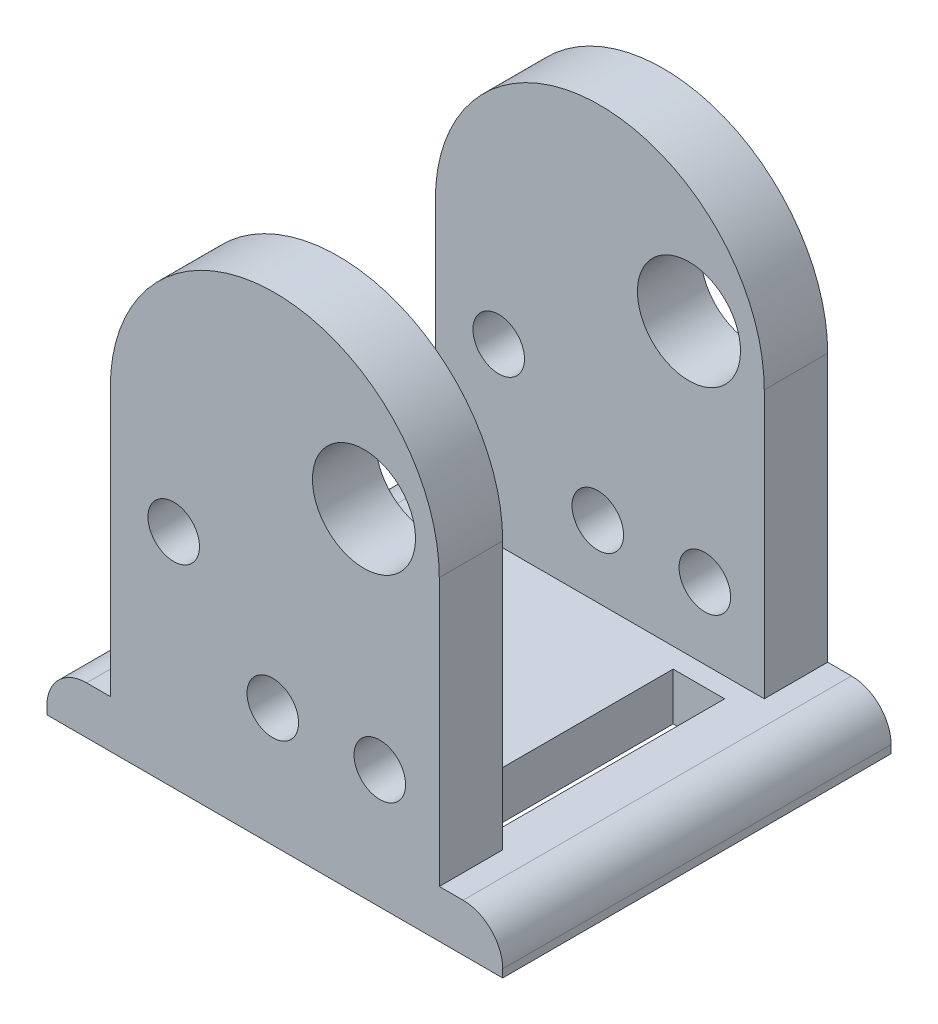
ISO-10303-21;
HEADER;
FILE_DESCRIPTION(('STEP AP214'),'2;1');
FILE_NAME('part.step','',(''),(''),'','','');
FILE_SCHEMA(('AUTOMOTIVE_DESIGN { 1 0 10303 214 1 1 1 1 }'));
ENDSEC;
DATA;
#1=APPLICATION_CONTEXT('core data for automotive mechanical design processes');
#2=APPLICATION_PROTOCOL_DEFINITION('international standard','automotive_design',2000,#1);
#3=PRODUCT_CONTEXT('',#1,'mechanical');
#4=PRODUCT('Part','Part','',(#3));
#5=PRODUCT_RELATED_PRODUCT_CATEGORY('part','',(#4));
#6=PRODUCT_DEFINITION_FORMATION('','',#4);
#7=PRODUCT_DEFINITION_CONTEXT('part definition',#1,'design');
#8=PRODUCT_DEFINITION('design','',#6,#7);
#9=PRODUCT_DEFINITION_SHAPE('','',#8);
#10=(LENGTH_UNIT() NAMED_UNIT(*) SI_UNIT(.MILLI.,.METRE.));
#11=(NAMED_UNIT(*) PLANE_ANGLE_UNIT() SI_UNIT($,.RADIAN.));
#12=(NAMED_UNIT(*) SI_UNIT($,.STERADIAN.) SOLID_ANGLE_UNIT());
#13=UNCERTAINTY_MEASURE_WITH_UNIT(LENGTH_MEASURE(1.E-05),#10,'distance_accuracy_value','');
#14=(GEOMETRIC_REPRESENTATION_CONTEXT(3) GLOBAL_UNCERTAINTY_ASSIGNED_CONTEXT((#13)) GLOBAL_UNIT_ASSIGNED_CONTEXT((#10,
#11,#12)) REPRESENTATION_CONTEXT('',''));
#15=CARTESIAN_POINT('',(0.,0.,0.));
#16=DIRECTION('',(0.,0.,1.));
#17=DIRECTION('',(1.,0.,0.));
#18=AXIS2_PLACEMENT_3D('',#15,#16,#17);
#19=CARTESIAN_POINT('',(10.541,20.193,24.892));
#20=DIRECTION('',(-1.,0.,0.));
#21=DIRECTION('',(0.,-1.,0.));
#22=AXIS2_PLACEMENT_3D('',#19,#20,#21);
#23=PLANE('',#22);
#24=DIRECTION('',(0.,0.,-1.));
#25=VECTOR('',#24,1.);
#26=CARTESIAN_POINT('',(10.541,20.193,24.892));
#27=LINE('',#26,#25);
#28=CARTESIAN_POINT('',(10.541,20.193,4.06399999999999));
#29=VERTEX_POINT('',#28);
#30=CARTESIAN_POINT('',(10.541,20.193,0.));
#31=VERTEX_POINT('',#30);
#32=EDGE_CURVE('E359',#29,#31,#27,.T.);
#33=ORIENTED_EDGE('',*,*,#32,.F.);
#34=DIRECTION('',(0.,1.,0.));
#35=VECTOR('',#34,1.);
#36=CARTESIAN_POINT('',(10.541,3.048,4.06399999999999));
#37=LINE('',#36,#35);
#38=CARTESIAN_POINT('',(10.541,3.048,4.06399999999999));
#39=VERTEX_POINT('',#38);
#40=EDGE_CURVE('E300',#39,#29,#37,.T.);
#41=ORIENTED_EDGE('',*,*,#40,.F.);
#42=DIRECTION('',(0.,0.,-1.));
#43=VECTOR('',#42,1.);
#44=CARTESIAN_POINT('',(10.541,3.048,24.892));
#45=LINE('',#44,#43);
#46=CARTESIAN_POINT('',(10.541,3.048,0.));
#47=VERTEX_POINT('',#46);
#48=EDGE_CURVE('E363',#39,#47,#45,.T.);
#49=ORIENTED_EDGE('',*,*,#48,.T.);
#50=DIRECTION('',(0.,1.,0.));
#51=VECTOR('',#50,1.);
#52=CARTESIAN_POINT('',(10.541,20.193,0.));
#53=LINE('',#52,#51);
#54=EDGE_CURVE('E341',#47,#31,#53,.T.);
#55=ORIENTED_EDGE('',*,*,#54,.T.);
#56=EDGE_LOOP('',(#33,#41,#49,#55));
#57=FACE_BOUND('',#56,.T.);
#58=ADVANCED_FACE('F33',(#57),#23,.F.);
#59=CARTESIAN_POINT('',(0.,20.193,24.892));
#60=DIRECTION('',(0.,0.,-1.));
#61=DIRECTION('',(-1.,0.,0.));
#62=AXIS2_PLACEMENT_3D('',#59,#60,#61);
#63=CYLINDRICAL_SURFACE('',#62,10.541);
#64=DIRECTION('',(0.,0.,-1.));
#65=VECTOR('',#64,1.);
#66=CARTESIAN_POINT('',(-10.541,20.193,24.892));
#67=LINE('',#66,#65);
#68=CARTESIAN_POINT('',(-10.541,20.193,4.06399999999999));
#69=VERTEX_POINT('',#68);
#70=CARTESIAN_POINT('',(-10.541,20.193,0.));
#71=VERTEX_POINT('',#70);
#72=EDGE_CURVE('E355',#69,#71,#67,.T.);
#73=ORIENTED_EDGE('',*,*,#72,.F.);
#74=CARTESIAN_POINT('',(0.,20.193,4.06399999999999));
#75=DIRECTION('',(0.,0.,-1.));
#76=DIRECTION('',(0.,1.,0.));
#77=AXIS2_PLACEMENT_3D('',#74,#75,#76);
#78=CIRCLE('',#77,10.541);
#79=EDGE_CURVE('E298',#29,#69,#78,.F.);
#80=ORIENTED_EDGE('',*,*,#79,.F.);
#81=ORIENTED_EDGE('',*,*,#32,.T.);
#82=CARTESIAN_POINT('',(0.,20.193,0.));
#83=DIRECTION('',(0.,0.,1.));
#84=DIRECTION('',(-1.,0.,0.));
#85=AXIS2_PLACEMENT_3D('',#82,#83,#84);
#86=CIRCLE('',#85,10.541);
#87=EDGE_CURVE('E344',#31,#71,#86,.T.);
#88=ORIENTED_EDGE('',*,*,#87,.T.);
#89=EDGE_LOOP('',(#73,#80,#81,#88));
#90=FACE_BOUND('',#89,.T.);
#91=ADVANCED_FACE('F422',(#90),#63,.T.);
#92=CARTESIAN_POINT('',(-10.541,3.048,24.892));
#93=DIRECTION('',(1.,0.,0.));
#94=DIRECTION('',(0.,1.,0.));
#95=AXIS2_PLACEMENT_3D('',#92,#93,#94);
#96=PLANE('',#95);
#97=DIRECTION('',(0.,0.,-1.));
#98=VECTOR('',#97,1.);
#99=CARTESIAN_POINT('',(-10.541,3.048,24.892));
#100=LINE('',#99,#98);
#101=CARTESIAN_POINT('',(-10.541,3.048,4.06399999999999));
#102=VERTEX_POINT('',#101);
#103=CARTESIAN_POINT('',(-10.541,3.048,0.));
#104=VERTEX_POINT('',#103);
#105=EDGE_CURVE('E333',#102,#104,#100,.T.);
#106=ORIENTED_EDGE('',*,*,#105,.F.);
#107=DIRECTION('',(0.,-1.,0.));
#108=VECTOR('',#107,1.);
#109=CARTESIAN_POINT('',(-10.541,3.048,4.06399999999999));
#110=LINE('',#109,#108);
#111=EDGE_CURVE('E304',#69,#102,#110,.T.);
#112=ORIENTED_EDGE('',*,*,#111,.F.);
#113=ORIENTED_EDGE('',*,*,#72,.T.);
#114=DIRECTION('',(0.,-1.,0.));
#115=VECTOR('',#114,1.);
#116=CARTESIAN_POINT('',(-10.541,3.048,0.));
#117=LINE('',#116,#115);
#118=EDGE_CURVE('E347',#71,#104,#117,.T.);
#119=ORIENTED_EDGE('',*,*,#118,.T.);
#120=EDGE_LOOP('',(#106,#112,#113,#119));
#121=FACE_BOUND('',#120,.T.);
#122=ADVANCED_FACE('F416',(#121),#96,.F.);
#123=CARTESIAN_POINT('',(-14.605,0.,24.892));
#124=DIRECTION('',(1.,0.,0.));
#125=DIRECTION('',(0.,0.,-1.));
#126=AXIS2_PLACEMENT_3D('',#123,#124,#125);
#127=PLANE('',#126);
#128=DIRECTION('',(0.,-1.,0.));
#129=VECTOR('',#128,1.);
#130=CARTESIAN_POINT('',(-14.605,0.,24.892));
#131=LINE('',#130,#129);
#132=CARTESIAN_POINT('',(-14.605,0.508,24.892));
#133=VERTEX_POINT('',#132);
#134=CARTESIAN_POINT('',(-14.605,0.,24.892));
#135=VERTEX_POINT('',#134);
#136=EDGE_CURVE('E315',#133,#135,#131,.T.);
#137=ORIENTED_EDGE('',*,*,#136,.F.);
#138=DIRECTION('',(0.,0.,-1.));
#139=VECTOR('',#138,1.);
#140=CARTESIAN_POINT('',(-14.605,0.508,24.892));
#141=LINE('',#140,#139);
#142=CARTESIAN_POINT('',(-14.605,0.508,0.));
#143=VERTEX_POINT('',#142);
#144=EDGE_CURVE('E373',#133,#143,#141,.T.);
#145=ORIENTED_EDGE('',*,*,#144,.T.);
#146=DIRECTION('',(0.,-1.,0.));
#147=VECTOR('',#146,1.);
#148=CARTESIAN_POINT('',(-14.605,0.,0.));
#149=LINE('',#148,#147);
#150=CARTESIAN_POINT('',(-14.605,0.,0.));
#151=VERTEX_POINT('',#150);
#152=EDGE_CURVE('E314',#143,#151,#149,.T.);
#153=ORIENTED_EDGE('',*,*,#152,.T.);
#154=DIRECTION('',(0.,0.,-1.));
#155=VECTOR('',#154,1.);
#156=CARTESIAN_POINT('',(-14.605,0.,24.892));
#157=LINE('',#156,#155);
#158=EDGE_CURVE('E370',#135,#151,#157,.T.);
#159=ORIENTED_EDGE('',*,*,#158,.F.);
#160=EDGE_LOOP('',(#137,#145,#153,#159));
#161=FACE_BOUND('',#160,.T.);
#162=ADVANCED_FACE('F403',(#161),#127,.F.);
#163=CARTESIAN_POINT('',(-14.605,0.,24.892));
#164=DIRECTION('',(0.,1.,0.));
#165=DIRECTION('',(0.,0.,1.));
#166=AXIS2_PLACEMENT_3D('',#163,#164,#165);
#167=PLANE('',#166);
#168=DIRECTION('',(1.,0.,0.));
#169=VECTOR('',#168,1.);
#170=CARTESIAN_POINT('',(5.969,0.,5.334));
#171=LINE('',#170,#169);
#172=CARTESIAN_POINT('',(5.969,0.,5.334));
#173=VERTEX_POINT('',#172);
#174=CARTESIAN_POINT('',(9.271,0.,5.334));
#175=VERTEX_POINT('',#174);
#176=EDGE_CURVE('E210',#173,#175,#171,.T.);
#177=ORIENTED_EDGE('',*,*,#176,.F.);
#178=DIRECTION('',(0.,0.,-1.));
#179=VECTOR('',#178,1.);
#180=CARTESIAN_POINT('',(5.969,0.,19.558));
#181=LINE('',#180,#179);
#182=CARTESIAN_POINT('',(5.969,0.,19.558));
#183=VERTEX_POINT('',#182);
#184=EDGE_CURVE('E189',#183,#173,#181,.T.);
#185=ORIENTED_EDGE('',*,*,#184,.F.);
#186=DIRECTION('',(-1.,0.,0.));
#187=VECTOR('',#186,1.);
#188=CARTESIAN_POINT('',(5.969,0.,19.558));
#189=LINE('',#188,#187);
#190=CARTESIAN_POINT('',(9.271,0.,19.558));
#191=VERTEX_POINT('',#190);
#192=EDGE_CURVE('E194',#191,#183,#189,.T.);
#193=ORIENTED_EDGE('',*,*,#192,.F.);
#194=DIRECTION('',(0.,0.,1.));
#195=VECTOR('',#194,1.);
#196=CARTESIAN_POINT('',(9.271,0.,19.558));
#197=LINE('',#196,#195);
#198=EDGE_CURVE('E217',#175,#191,#197,.T.);
#199=ORIENTED_EDGE('',*,*,#198,.F.);
#200=EDGE_LOOP('',(#177,#185,#193,#199));
#201=FACE_BOUND('',#200,.T.);
#202=DIRECTION('',(1.,0.,0.));
#203=VECTOR('',#202,1.);
#204=CARTESIAN_POINT('',(-9.22681859443985,0.,5.334));
#205=LINE('',#204,#203);
#206=CARTESIAN_POINT('',(-9.22681859443985,0.,5.334));
#207=VERTEX_POINT('',#206);
#208=CARTESIAN_POINT('',(-5.41681859443985,0.,5.334));
#209=VERTEX_POINT('',#208);
#210=EDGE_CURVE('E235',#207,#209,#205,.T.);
#211=ORIENTED_EDGE('',*,*,#210,.F.);
#212=DIRECTION('',(0.,0.,-1.));
#213=VECTOR('',#212,1.);
#214=CARTESIAN_POINT('',(-9.22681859443985,0.,19.558));
#215=LINE('',#214,#213);
#216=CARTESIAN_POINT('',(-9.22681859443985,0.,19.558));
#217=VERTEX_POINT('',#216);
#218=EDGE_CURVE('E233',#217,#207,#215,.T.);
#219=ORIENTED_EDGE('',*,*,#218,.F.);
#220=DIRECTION('',(-1.,0.,0.));
#221=VECTOR('',#220,1.);
#222=CARTESIAN_POINT('',(-9.22681859443985,0.,19.558));
#223=LINE('',#222,#221);
#224=CARTESIAN_POINT('',(-5.41681859443985,0.,19.558));
#225=VERTEX_POINT('',#224);
#226=EDGE_CURVE('E241',#225,#217,#223,.T.);
#227=ORIENTED_EDGE('',*,*,#226,.F.);
#228=DIRECTION('',(0.,0.,1.));
#229=VECTOR('',#228,1.);
#230=CARTESIAN_POINT('',(-5.41681859443985,0.,19.558));
#231=LINE('',#230,#229);
#232=EDGE_CURVE('E238',#209,#225,#231,.T.);
#233=ORIENTED_EDGE('',*,*,#232,.F.);
#234=EDGE_LOOP('',(#211,#219,#227,#233));
#235=FACE_BOUND('',#234,.T.);
#236=DIRECTION('',(1.,0.,0.));
#237=VECTOR('',#236,1.);
#238=CARTESIAN_POINT('',(-14.605,0.,0.));
#239=LINE('',#238,#237);
#240=CARTESIAN_POINT('',(14.605,0.,0.));
#241=VERTEX_POINT('',#240);
#242=EDGE_CURVE('E335',#151,#241,#239,.T.);
#243=ORIENTED_EDGE('',*,*,#242,.T.);
#244=DIRECTION('',(0.,0.,-1.));
#245=VECTOR('',#244,1.);
#246=CARTESIAN_POINT('',(14.605,0.,24.892));
#247=LINE('',#246,#245);
#248=CARTESIAN_POINT('',(14.605,0.,24.892));
#249=VERTEX_POINT('',#248);
#250=EDGE_CURVE('E367',#249,#241,#247,.T.);
#251=ORIENTED_EDGE('',*,*,#250,.F.);
#252=DIRECTION('',(1.,0.,0.));
#253=VECTOR('',#252,1.);
#254=CARTESIAN_POINT('',(-14.605,0.,24.892));
#255=LINE('',#254,#253);
#256=EDGE_CURVE('E317',#135,#249,#255,.T.);
#257=ORIENTED_EDGE('',*,*,#256,.F.);
#258=ORIENTED_EDGE('',*,*,#158,.T.);
#259=EDGE_LOOP('',(#243,#251,#257,#258));
#260=FACE_BOUND('',#259,.T.);
#261=ADVANCED_FACE('F454',(#201,#235,#260),#167,.F.);
#262=CARTESIAN_POINT('',(14.605,3.048,24.892));
#263=DIRECTION('',(-1.,0.,0.));
#264=DIRECTION('',(0.,0.,1.));
#265=AXIS2_PLACEMENT_3D('',#262,#263,#264);
#266=PLANE('',#265);
#267=DIRECTION('',(0.,1.,0.));
#268=VECTOR('',#267,1.);
#269=CARTESIAN_POINT('',(14.605,3.048,0.));
#270=LINE('',#269,#268);
#271=CARTESIAN_POINT('',(14.605,0.508000000000001,0.));
#272=VERTEX_POINT('',#271);
#273=EDGE_CURVE('E337',#241,#272,#270,.T.);
#274=ORIENTED_EDGE('',*,*,#273,.T.);
#275=DIRECTION('',(0.,0.,-1.));
#276=VECTOR('',#275,1.);
#277=CARTESIAN_POINT('',(14.605,0.508,24.892));
#278=LINE('',#277,#276);
#279=CARTESIAN_POINT('',(14.605,0.508000000000001,24.892));
#280=VERTEX_POINT('',#279);
#281=EDGE_CURVE('E11',#272,#280,#278,.F.);
#282=ORIENTED_EDGE('',*,*,#281,.T.);
#283=DIRECTION('',(0.,1.,0.));
#284=VECTOR('',#283,1.);
#285=CARTESIAN_POINT('',(14.605,3.048,24.892));
#286=LINE('',#285,#284);
#287=EDGE_CURVE('E320',#249,#280,#286,.T.);
#288=ORIENTED_EDGE('',*,*,#287,.F.);
#289=ORIENTED_EDGE('',*,*,#250,.T.);
#290=EDGE_LOOP('',(#274,#282,#288,#289));
#291=FACE_BOUND('',#290,.T.);
#292=ADVANCED_FACE('F431',(#291),#266,.F.);
#293=CARTESIAN_POINT('',(10.541,3.048,24.892));
#294=VERTEX_POINT('',#293);
#295=CARTESIAN_POINT('',(10.541,3.048,20.828));
#296=VERTEX_POINT('',#295);
#297=EDGE_CURVE('E364',#294,#296,#45,.T.);
#298=ORIENTED_EDGE('',*,*,#297,.T.);
#299=DIRECTION('',(0.,-1.,0.));
#300=VECTOR('',#299,1.);
#301=CARTESIAN_POINT('',(10.541,30.734,20.828));
#302=LINE('',#301,#300);
#303=CARTESIAN_POINT('',(10.541,20.193,20.828));
#304=VERTEX_POINT('',#303);
#305=EDGE_CURVE('E310',#304,#296,#302,.T.);
#306=ORIENTED_EDGE('',*,*,#305,.F.);
#307=CARTESIAN_POINT('',(10.541,20.193,24.892));
#308=VERTEX_POINT('',#307);
#309=EDGE_CURVE('E360',#308,#304,#27,.T.);
#310=ORIENTED_EDGE('',*,*,#309,.F.);
#311=DIRECTION('',(0.,1.,0.));
#312=VECTOR('',#311,1.);
#313=CARTESIAN_POINT('',(10.541,20.193,24.892));
#314=LINE('',#313,#312);
#315=EDGE_CURVE('E324',#294,#308,#314,.T.);
#316=ORIENTED_EDGE('',*,*,#315,.F.);
#317=EDGE_LOOP('',(#298,#306,#310,#316));
#318=FACE_BOUND('',#317,.T.);
#319=ADVANCED_FACE('F439',(#318),#23,.F.);
#320=ORIENTED_EDGE('',*,*,#309,.T.);
#321=CARTESIAN_POINT('',(0.,20.193,20.828));
#322=DIRECTION('',(0.,0.,1.));
#323=DIRECTION('',(0.,-1.,0.));
#324=AXIS2_PLACEMENT_3D('',#321,#322,#323);
#325=CIRCLE('',#324,10.541);
#326=CARTESIAN_POINT('',(-10.541,20.193,20.828));
#327=VERTEX_POINT('',#326);
#328=EDGE_CURVE('E296',#327,#304,#325,.F.);
#329=ORIENTED_EDGE('',*,*,#328,.F.);
#330=CARTESIAN_POINT('',(-10.541,20.193,24.892));
#331=VERTEX_POINT('',#330);
#332=EDGE_CURVE('E356',#331,#327,#67,.T.);
#333=ORIENTED_EDGE('',*,*,#332,.F.);
#334=CARTESIAN_POINT('',(0.,20.193,24.892));
#335=DIRECTION('',(0.,0.,1.));
#336=DIRECTION('',(-1.,0.,0.));
#337=AXIS2_PLACEMENT_3D('',#334,#335,#336);
#338=CIRCLE('',#337,10.541);
#339=EDGE_CURVE('E326',#308,#331,#338,.T.);
#340=ORIENTED_EDGE('',*,*,#339,.F.);
#341=EDGE_LOOP('',(#320,#329,#333,#340));
#342=FACE_BOUND('',#341,.T.);
#343=ADVANCED_FACE('F444',(#342),#63,.T.);
#344=ORIENTED_EDGE('',*,*,#332,.T.);
#345=DIRECTION('',(0.,1.,0.));
#346=VECTOR('',#345,1.);
#347=CARTESIAN_POINT('',(-10.541,30.734,20.828));
#348=LINE('',#347,#346);
#349=CARTESIAN_POINT('',(-10.541,3.048,20.828));
#350=VERTEX_POINT('',#349);
#351=EDGE_CURVE('E302',#350,#327,#348,.T.);
#352=ORIENTED_EDGE('',*,*,#351,.F.);
#353=CARTESIAN_POINT('',(-10.541,3.048,24.892));
#354=VERTEX_POINT('',#353);
#355=EDGE_CURVE('E352',#354,#350,#100,.T.);
#356=ORIENTED_EDGE('',*,*,#355,.F.);
#357=DIRECTION('',(0.,-1.,0.));
#358=VECTOR('',#357,1.);
#359=CARTESIAN_POINT('',(-10.541,3.048,24.892));
#360=LINE('',#359,#358);
#361=EDGE_CURVE('E328',#331,#354,#360,.T.);
#362=ORIENTED_EDGE('',*,*,#361,.F.);
#363=EDGE_LOOP('',(#344,#352,#356,#362));
#364=FACE_BOUND('',#363,.T.);
#365=ADVANCED_FACE('F452',(#364),#96,.F.);
#366=CARTESIAN_POINT('',(-14.605,3.048,24.892));
#367=DIRECTION('',(0.,-1.,0.));
#368=DIRECTION('',(0.,0.,-1.));
#369=AXIS2_PLACEMENT_3D('',#366,#367,#368);
#370=PLANE('',#369);
#371=DIRECTION('',(1.,0.,0.));
#372=VECTOR('',#371,1.);
#373=CARTESIAN_POINT('',(5.969,3.048,19.558));
#374=LINE('',#373,#372);
#375=CARTESIAN_POINT('',(5.969,3.048,19.558));
#376=VERTEX_POINT('',#375);
#377=CARTESIAN_POINT('',(9.271,3.048,19.558));
#378=VERTEX_POINT('',#377);
#379=EDGE_CURVE('E208',#376,#378,#374,.T.);
#380=ORIENTED_EDGE('',*,*,#379,.F.);
#381=DIRECTION('',(0.,0.,1.));
#382=VECTOR('',#381,1.);
#383=CARTESIAN_POINT('',(5.969,3.048,19.558));
#384=LINE('',#383,#382);
#385=CARTESIAN_POINT('',(5.969,3.048,5.334));
#386=VERTEX_POINT('',#385);
#387=EDGE_CURVE('E186',#386,#376,#384,.T.);
#388=ORIENTED_EDGE('',*,*,#387,.F.);
#389=DIRECTION('',(-1.,0.,0.));
#390=VECTOR('',#389,1.);
#391=CARTESIAN_POINT('',(5.969,3.048,5.334));
#392=LINE('',#391,#390);
#393=CARTESIAN_POINT('',(9.271,3.048,5.334));
#394=VERTEX_POINT('',#393);
#395=EDGE_CURVE('E198',#394,#386,#392,.T.);
#396=ORIENTED_EDGE('',*,*,#395,.F.);
#397=DIRECTION('',(0.,0.,-1.));
#398=VECTOR('',#397,1.);
#399=CARTESIAN_POINT('',(9.271,3.048,19.558));
#400=LINE('',#399,#398);
#401=EDGE_CURVE('E212',#378,#394,#400,.T.);
#402=ORIENTED_EDGE('',*,*,#401,.F.);
#403=EDGE_LOOP('',(#380,#388,#396,#402));
#404=FACE_BOUND('',#403,.T.);
#405=DIRECTION('',(1.,0.,0.));
#406=VECTOR('',#405,1.);
#407=CARTESIAN_POINT('',(-9.22681859443985,3.048,19.558));
#408=LINE('',#407,#406);
#409=CARTESIAN_POINT('',(-9.22681859443985,3.048,19.558));
#410=VERTEX_POINT('',#409);
#411=CARTESIAN_POINT('',(-5.41681859443985,3.048,19.558));
#412=VERTEX_POINT('',#411);
#413=EDGE_CURVE('E227',#410,#412,#408,.T.);
#414=ORIENTED_EDGE('',*,*,#413,.F.);
#415=DIRECTION('',(0.,0.,1.));
#416=VECTOR('',#415,1.);
#417=CARTESIAN_POINT('',(-9.22681859443985,3.048,19.558));
#418=LINE('',#417,#416);
#419=CARTESIAN_POINT('',(-9.22681859443985,3.048,5.334));
#420=VERTEX_POINT('',#419);
#421=EDGE_CURVE('E230',#420,#410,#418,.T.);
#422=ORIENTED_EDGE('',*,*,#421,.F.);
#423=DIRECTION('',(-1.,0.,0.));
#424=VECTOR('',#423,1.);
#425=CARTESIAN_POINT('',(-9.22681859443985,3.048,5.334));
#426=LINE('',#425,#424);
#427=CARTESIAN_POINT('',(-5.41681859443985,3.048,5.334));
#428=VERTEX_POINT('',#427);
#429=EDGE_CURVE('E247',#428,#420,#426,.T.);
#430=ORIENTED_EDGE('',*,*,#429,.F.);
#431=DIRECTION('',(0.,0.,-1.));
#432=VECTOR('',#431,1.);
#433=CARTESIAN_POINT('',(-5.41681859443985,3.048,19.558));
#434=LINE('',#433,#432);
#435=EDGE_CURVE('E202',#412,#428,#434,.T.);
#436=ORIENTED_EDGE('',*,*,#435,.F.);
#437=EDGE_LOOP('',(#414,#422,#430,#436));
#438=FACE_BOUND('',#437,.T.);
#439=DIRECTION('',(-1.,0.,0.));
#440=VECTOR('',#439,1.);
#441=CARTESIAN_POINT('',(-14.605,3.048,0.));
#442=LINE('',#441,#440);
#443=CARTESIAN_POINT('',(-12.065,3.048,0.));
#444=VERTEX_POINT('',#443);
#445=EDGE_CURVE('E318',#104,#444,#442,.T.);
#446=ORIENTED_EDGE('',*,*,#445,.T.);
#447=DIRECTION('',(0.,0.,-1.));
#448=VECTOR('',#447,1.);
#449=CARTESIAN_POINT('',(-12.065,3.048,24.892));
#450=LINE('',#449,#448);
#451=CARTESIAN_POINT('',(-12.065,3.048,24.892));
#452=VERTEX_POINT('',#451);
#453=EDGE_CURVE('E391',#444,#452,#450,.F.);
#454=ORIENTED_EDGE('',*,*,#453,.T.);
#455=DIRECTION('',(-1.,0.,0.));
#456=VECTOR('',#455,1.);
#457=CARTESIAN_POINT('',(-14.605,3.048,24.892));
#458=LINE('',#457,#456);
#459=EDGE_CURVE('E330',#354,#452,#458,.T.);
#460=ORIENTED_EDGE('',*,*,#459,.F.);
#461=ORIENTED_EDGE('',*,*,#355,.T.);
#462=DIRECTION('',(-1.,0.,0.));
#463=VECTOR('',#462,1.);
#464=CARTESIAN_POINT('',(14.606,3.048,20.828));
#465=LINE('',#464,#463);
#466=EDGE_CURVE('E306',#296,#350,#465,.T.);
#467=ORIENTED_EDGE('',*,*,#466,.F.);
#468=ORIENTED_EDGE('',*,*,#297,.F.);
#469=DIRECTION('',(-1.,0.,0.));
#470=VECTOR('',#469,1.);
#471=CARTESIAN_POINT('',(10.541,3.048,24.892));
#472=LINE('',#471,#470);
#473=CARTESIAN_POINT('',(12.065,3.048,24.892));
#474=VERTEX_POINT('',#473);
#475=EDGE_CURVE('E322',#474,#294,#472,.T.);
#476=ORIENTED_EDGE('',*,*,#475,.F.);
#477=DIRECTION('',(0.,0.,-1.));
#478=VECTOR('',#477,1.);
#479=CARTESIAN_POINT('',(12.065,3.048,24.892));
#480=LINE('',#479,#478);
#481=CARTESIAN_POINT('',(12.065,3.048,0.));
#482=VERTEX_POINT('',#481);
#483=EDGE_CURVE('E388',#474,#482,#480,.T.);
#484=ORIENTED_EDGE('',*,*,#483,.T.);
#485=DIRECTION('',(-1.,0.,0.));
#486=VECTOR('',#485,1.);
#487=CARTESIAN_POINT('',(10.541,3.048,0.));
#488=LINE('',#487,#486);
#489=EDGE_CURVE('E339',#482,#47,#488,.T.);
#490=ORIENTED_EDGE('',*,*,#489,.T.);
#491=ORIENTED_EDGE('',*,*,#48,.F.);
#492=DIRECTION('',(-1.,0.,0.));
#493=VECTOR('',#492,1.);
#494=CARTESIAN_POINT('',(14.606,3.048,4.06399999999999));
#495=LINE('',#494,#493);
#496=EDGE_CURVE('E307',#39,#102,#495,.T.);
#497=ORIENTED_EDGE('',*,*,#496,.T.);
#498=ORIENTED_EDGE('',*,*,#105,.T.);
#499=EDGE_LOOP('',(#446,#454,#460,#461,#467,#468,#476,#484,#490,#491,#497,#498));
#500=FACE_BOUND('',#499,.T.);
#501=ADVANCED_FACE('F205',(#404,#438,#500),#370,.F.);
#502=CARTESIAN_POINT('',(0.,20.193,24.892));
#503=DIRECTION('',(0.,0.,-1.));
#504=DIRECTION('',(-1.,0.,0.));
#505=AXIS2_PLACEMENT_3D('',#502,#503,#504);
#506=PLANE('',#505);
#507=CARTESIAN_POINT('',(-6.477,14.224,24.892));
#508=DIRECTION('',(0.,0.,-1.));
#509=DIRECTION('',(-1.,0.,0.));
#510=AXIS2_PLACEMENT_3D('',#507,#508,#509);
#511=CIRCLE('',#510,1.651);
#512=CARTESIAN_POINT('',(-8.128,14.224,24.892));
#513=VERTEX_POINT('',#512);
#514=EDGE_CURVE('E259',#513,#513,#511,.F.);
#515=ORIENTED_EDGE('',*,*,#514,.F.);
#516=EDGE_LOOP('',(#515));
#517=FACE_BOUND('',#516,.T.);
#518=CARTESIAN_POINT('',(-0.127,7.62,24.892));
#519=DIRECTION('',(0.,0.,-1.));
#520=DIRECTION('',(-1.,0.,0.));
#521=AXIS2_PLACEMENT_3D('',#518,#519,#520);
#522=CIRCLE('',#521,1.651);
#523=CARTESIAN_POINT('',(-1.778,7.62,24.892));
#524=VERTEX_POINT('',#523);
#525=EDGE_CURVE('E269',#524,#524,#522,.F.);
#526=ORIENTED_EDGE('',*,*,#525,.F.);
#527=EDGE_LOOP('',(#526));
#528=FACE_BOUND('',#527,.T.);
#529=CARTESIAN_POINT('',(6.731,7.62,24.892));
#530=DIRECTION('',(0.,0.,-1.));
#531=DIRECTION('',(-1.,0.,0.));
#532=AXIS2_PLACEMENT_3D('',#529,#530,#531);
#533=CIRCLE('',#532,1.651);
#534=CARTESIAN_POINT('',(5.08,7.62,24.892));
#535=VERTEX_POINT('',#534);
#536=EDGE_CURVE('E279',#535,#535,#533,.F.);
#537=ORIENTED_EDGE('',*,*,#536,.F.);
#538=EDGE_LOOP('',(#537));
#539=FACE_BOUND('',#538,.T.);
#540=CARTESIAN_POINT('',(5.715,21.59,24.892));
#541=DIRECTION('',(0.,0.,-1.));
#542=DIRECTION('',(-1.,0.,0.));
#543=AXIS2_PLACEMENT_3D('',#540,#541,#542);
#544=CIRCLE('',#543,3.302);
#545=CARTESIAN_POINT('',(2.413,21.59,24.892));
#546=VERTEX_POINT('',#545);
#547=EDGE_CURVE('E289',#546,#546,#544,.F.);
#548=ORIENTED_EDGE('',*,*,#547,.F.);
#549=EDGE_LOOP('',(#548));
#550=FACE_BOUND('',#549,.T.);
#551=ORIENTED_EDGE('',*,*,#459,.T.);
#552=CARTESIAN_POINT('',(-12.065,0.508,24.892));
#553=DIRECTION('',(0.,0.,-1.));
#554=DIRECTION('',(-1.,0.,0.));
#555=AXIS2_PLACEMENT_3D('',#552,#553,#554);
#556=CIRCLE('',#555,2.54);
#557=EDGE_CURVE('E41',#452,#133,#556,.F.);
#558=ORIENTED_EDGE('',*,*,#557,.T.);
#559=ORIENTED_EDGE('',*,*,#136,.T.);
#560=ORIENTED_EDGE('',*,*,#256,.T.);
#561=ORIENTED_EDGE('',*,*,#287,.T.);
#562=CARTESIAN_POINT('',(12.065,0.508,24.892));
#563=DIRECTION('',(0.,0.,-1.));
#564=DIRECTION('',(-1.,0.,0.));
#565=AXIS2_PLACEMENT_3D('',#562,#563,#564);
#566=CIRCLE('',#565,2.54);
#567=EDGE_CURVE('E53',#280,#474,#566,.F.);
#568=ORIENTED_EDGE('',*,*,#567,.T.);
#569=ORIENTED_EDGE('',*,*,#475,.T.);
#570=ORIENTED_EDGE('',*,*,#315,.T.);
#571=ORIENTED_EDGE('',*,*,#339,.T.);
#572=ORIENTED_EDGE('',*,*,#361,.T.);
#573=EDGE_LOOP('',(#551,#558,#559,#560,#561,#568,#569,#570,#571,#572));
#574=FACE_BOUND('',#573,.T.);
#575=ADVANCED_FACE('F395',(#517,#528,#539,#550,#574),#506,.F.);
#576=CARTESIAN_POINT('',(0.,20.193,0.));
#577=DIRECTION('',(0.,0.,-1.));
#578=DIRECTION('',(-1.,0.,0.));
#579=AXIS2_PLACEMENT_3D('',#576,#577,#578);
#580=PLANE('',#579);
#581=CARTESIAN_POINT('',(-6.477,14.224,0.));
#582=DIRECTION('',(0.,0.,-1.));
#583=DIRECTION('',(-1.,0.,0.));
#584=AXIS2_PLACEMENT_3D('',#581,#582,#583);
#585=CIRCLE('',#584,1.651);
#586=CARTESIAN_POINT('',(-8.128,14.224,0.));
#587=VERTEX_POINT('',#586);
#588=EDGE_CURVE('E256',#587,#587,#585,.T.);
#589=ORIENTED_EDGE('',*,*,#588,.F.);
#590=EDGE_LOOP('',(#589));
#591=FACE_BOUND('',#590,.T.);
#592=CARTESIAN_POINT('',(-0.127,7.62,0.));
#593=DIRECTION('',(0.,0.,-1.));
#594=DIRECTION('',(-1.,0.,0.));
#595=AXIS2_PLACEMENT_3D('',#592,#593,#594);
#596=CIRCLE('',#595,1.651);
#597=CARTESIAN_POINT('',(-1.778,7.62,0.));
#598=VERTEX_POINT('',#597);
#599=EDGE_CURVE('E266',#598,#598,#596,.T.);
#600=ORIENTED_EDGE('',*,*,#599,.F.);
#601=EDGE_LOOP('',(#600));
#602=FACE_BOUND('',#601,.T.);
#603=CARTESIAN_POINT('',(6.731,7.62,0.));
#604=DIRECTION('',(0.,0.,-1.));
#605=DIRECTION('',(-1.,0.,0.));
#606=AXIS2_PLACEMENT_3D('',#603,#604,#605);
#607=CIRCLE('',#606,1.651);
#608=CARTESIAN_POINT('',(5.08,7.62,0.));
#609=VERTEX_POINT('',#608);
#610=EDGE_CURVE('E276',#609,#609,#607,.T.);
#611=ORIENTED_EDGE('',*,*,#610,.F.);
#612=EDGE_LOOP('',(#611));
#613=FACE_BOUND('',#612,.T.);
#614=CARTESIAN_POINT('',(5.715,21.59,0.));
#615=DIRECTION('',(0.,0.,-1.));
#616=DIRECTION('',(-1.,0.,0.));
#617=AXIS2_PLACEMENT_3D('',#614,#615,#616);
#618=CIRCLE('',#617,3.302);
#619=CARTESIAN_POINT('',(2.413,21.59,0.));
#620=VERTEX_POINT('',#619);
#621=EDGE_CURVE('E286',#620,#620,#618,.T.);
#622=ORIENTED_EDGE('',*,*,#621,.F.);
#623=EDGE_LOOP('',(#622));
#624=FACE_BOUND('',#623,.T.);
#625=ORIENTED_EDGE('',*,*,#152,.F.);
#626=CARTESIAN_POINT('',(-12.065,0.508,0.));
#627=DIRECTION('',(0.,0.,-1.));
#628=DIRECTION('',(-1.,0.,0.));
#629=AXIS2_PLACEMENT_3D('',#626,#627,#628);
#630=CIRCLE('',#629,2.54);
#631=EDGE_CURVE('E386',#143,#444,#630,.T.);
#632=ORIENTED_EDGE('',*,*,#631,.T.);
#633=ORIENTED_EDGE('',*,*,#445,.F.);
#634=ORIENTED_EDGE('',*,*,#118,.F.);
#635=ORIENTED_EDGE('',*,*,#87,.F.);
#636=ORIENTED_EDGE('',*,*,#54,.F.);
#637=ORIENTED_EDGE('',*,*,#489,.F.);
#638=CARTESIAN_POINT('',(12.065,0.508,0.));
#639=DIRECTION('',(0.,0.,-1.));
#640=DIRECTION('',(-1.,0.,0.));
#641=AXIS2_PLACEMENT_3D('',#638,#639,#640);
#642=CIRCLE('',#641,2.54);
#643=EDGE_CURVE('E384',#482,#272,#642,.T.);
#644=ORIENTED_EDGE('',*,*,#643,.T.);
#645=ORIENTED_EDGE('',*,*,#273,.F.);
#646=ORIENTED_EDGE('',*,*,#242,.F.);
#647=EDGE_LOOP('',(#625,#632,#633,#634,#635,#636,#637,#644,#645,#646));
#648=FACE_BOUND('',#647,.T.);
#649=ADVANCED_FACE('F408',(#591,#602,#613,#624,#648),#580,.T.);
#650=CARTESIAN_POINT('',(14.606,3.048,4.06399999999999));
#651=DIRECTION('',(0.,0.,-1.));
#652=DIRECTION('',(0.,1.,0.));
#653=AXIS2_PLACEMENT_3D('',#650,#651,#652);
#654=PLANE('',#653);
#655=CARTESIAN_POINT('',(-6.477,14.224,4.06399999999999));
#656=DIRECTION('',(0.,0.,-1.));
#657=DIRECTION('',(0.,1.,0.));
#658=AXIS2_PLACEMENT_3D('',#655,#656,#657);
#659=CIRCLE('',#658,1.651);
#660=CARTESIAN_POINT('',(-6.477,15.875,4.06399999999999));
#661=VERTEX_POINT('',#660);
#662=EDGE_CURVE('E263',#661,#661,#659,.T.);
#663=ORIENTED_EDGE('',*,*,#662,.T.);
#664=EDGE_LOOP('',(#663));
#665=FACE_BOUND('',#664,.T.);
#666=CARTESIAN_POINT('',(-0.127,7.62,4.06399999999999));
#667=DIRECTION('',(0.,0.,-1.));
#668=DIRECTION('',(0.,1.,0.));
#669=AXIS2_PLACEMENT_3D('',#666,#667,#668);
#670=CIRCLE('',#669,1.651);
#671=CARTESIAN_POINT('',(-0.127,9.271,4.06399999999999));
#672=VERTEX_POINT('',#671);
#673=EDGE_CURVE('E273',#672,#672,#670,.T.);
#674=ORIENTED_EDGE('',*,*,#673,.T.);
#675=EDGE_LOOP('',(#674));
#676=FACE_BOUND('',#675,.T.);
#677=CARTESIAN_POINT('',(6.731,7.62,4.06399999999999));
#678=DIRECTION('',(0.,0.,-1.));
#679=DIRECTION('',(0.,1.,0.));
#680=AXIS2_PLACEMENT_3D('',#677,#678,#679);
#681=CIRCLE('',#680,1.651);
#682=CARTESIAN_POINT('',(6.731,9.271,4.06399999999999));
#683=VERTEX_POINT('',#682);
#684=EDGE_CURVE('E283',#683,#683,#681,.T.);
#685=ORIENTED_EDGE('',*,*,#684,.T.);
#686=EDGE_LOOP('',(#685));
#687=FACE_BOUND('',#686,.T.);
#688=CARTESIAN_POINT('',(5.715,21.59,4.06399999999999));
#689=DIRECTION('',(0.,0.,-1.));
#690=DIRECTION('',(0.,1.,0.));
#691=AXIS2_PLACEMENT_3D('',#688,#689,#690);
#692=CIRCLE('',#691,3.302);
#693=CARTESIAN_POINT('',(5.715,24.892,4.06399999999999));
#694=VERTEX_POINT('',#693);
#695=EDGE_CURVE('E293',#694,#694,#692,.T.);
#696=ORIENTED_EDGE('',*,*,#695,.T.);
#697=EDGE_LOOP('',(#696));
#698=FACE_BOUND('',#697,.T.);
#699=ORIENTED_EDGE('',*,*,#40,.T.);
#700=ORIENTED_EDGE('',*,*,#79,.T.);
#701=ORIENTED_EDGE('',*,*,#111,.T.);
#702=ORIENTED_EDGE('',*,*,#496,.F.);
#703=EDGE_LOOP('',(#699,#700,#701,#702));
#704=FACE_BOUND('',#703,.T.);
#705=ADVANCED_FACE('F538',(#665,#676,#687,#698,#704),#654,.F.);
#706=CARTESIAN_POINT('',(14.606,30.734,20.828));
#707=DIRECTION('',(0.,0.,1.));
#708=DIRECTION('',(0.,-1.,0.));
#709=AXIS2_PLACEMENT_3D('',#706,#707,#708);
#710=PLANE('',#709);
#711=CARTESIAN_POINT('',(-6.477,14.224,20.828));
#712=DIRECTION('',(0.,0.,1.));
#713=DIRECTION('',(0.,-1.,0.));
#714=AXIS2_PLACEMENT_3D('',#711,#712,#713);
#715=CIRCLE('',#714,1.651);
#716=CARTESIAN_POINT('',(-6.477,12.573,20.828));
#717=VERTEX_POINT('',#716);
#718=EDGE_CURVE('E262',#717,#717,#715,.T.);
#719=ORIENTED_EDGE('',*,*,#718,.T.);
#720=EDGE_LOOP('',(#719));
#721=FACE_BOUND('',#720,.T.);
#722=CARTESIAN_POINT('',(-0.127,7.62,20.828));
#723=DIRECTION('',(0.,0.,1.));
#724=DIRECTION('',(0.,-1.,0.));
#725=AXIS2_PLACEMENT_3D('',#722,#723,#724);
#726=CIRCLE('',#725,1.651);
#727=CARTESIAN_POINT('',(-0.127,5.969,20.828));
#728=VERTEX_POINT('',#727);
#729=EDGE_CURVE('E272',#728,#728,#726,.T.);
#730=ORIENTED_EDGE('',*,*,#729,.T.);
#731=EDGE_LOOP('',(#730));
#732=FACE_BOUND('',#731,.T.);
#733=CARTESIAN_POINT('',(6.731,7.62,20.828));
#734=DIRECTION('',(0.,0.,1.));
#735=DIRECTION('',(0.,-1.,0.));
#736=AXIS2_PLACEMENT_3D('',#733,#734,#735);
#737=CIRCLE('',#736,1.651);
#738=CARTESIAN_POINT('',(6.731,5.969,20.828));
#739=VERTEX_POINT('',#738);
#740=EDGE_CURVE('E282',#739,#739,#737,.T.);
#741=ORIENTED_EDGE('',*,*,#740,.T.);
#742=EDGE_LOOP('',(#741));
#743=FACE_BOUND('',#742,.T.);
#744=CARTESIAN_POINT('',(5.715,21.59,20.828));
#745=DIRECTION('',(0.,0.,1.));
#746=DIRECTION('',(0.,-1.,0.));
#747=AXIS2_PLACEMENT_3D('',#744,#745,#746);
#748=CIRCLE('',#747,3.302);
#749=CARTESIAN_POINT('',(5.715,18.288,20.828));
#750=VERTEX_POINT('',#749);
#751=EDGE_CURVE('E292',#750,#750,#748,.T.);
#752=ORIENTED_EDGE('',*,*,#751,.T.);
#753=EDGE_LOOP('',(#752));
#754=FACE_BOUND('',#753,.T.);
#755=ORIENTED_EDGE('',*,*,#305,.T.);
#756=ORIENTED_EDGE('',*,*,#466,.T.);
#757=ORIENTED_EDGE('',*,*,#351,.T.);
#758=ORIENTED_EDGE('',*,*,#328,.T.);
#759=EDGE_LOOP('',(#755,#756,#757,#758));
#760=FACE_BOUND('',#759,.T.);
#761=ADVANCED_FACE('F462',(#721,#732,#743,#754,#760),#710,.F.);
#762=CARTESIAN_POINT('',(5.715,21.59,34.2314663659119));
#763=DIRECTION('',(0.,0.,-1.));
#764=DIRECTION('',(-1.,0.,0.));
#765=AXIS2_PLACEMENT_3D('',#762,#763,#764);
#766=CYLINDRICAL_SURFACE('',#765,3.302);
#767=ORIENTED_EDGE('',*,*,#547,.T.);
#768=EDGE_LOOP('',(#767));
#769=FACE_BOUND('',#768,.T.);
#770=ORIENTED_EDGE('',*,*,#751,.F.);
#771=EDGE_LOOP('',(#770));
#772=FACE_BOUND('',#771,.T.);
#773=ADVANCED_FACE('F536',(#769,#772),#766,.F.);
#774=ORIENTED_EDGE('',*,*,#621,.T.);
#775=EDGE_LOOP('',(#774));
#776=FACE_BOUND('',#775,.T.);
#777=ORIENTED_EDGE('',*,*,#695,.F.);
#778=EDGE_LOOP('',(#777));
#779=FACE_BOUND('',#778,.T.);
#780=ADVANCED_FACE('F533',(#776,#779),#766,.F.);
#781=CARTESIAN_POINT('',(6.731,7.62,34.2314663659119));
#782=DIRECTION('',(0.,0.,-1.));
#783=DIRECTION('',(-1.,0.,0.));
#784=AXIS2_PLACEMENT_3D('',#781,#782,#783);
#785=CYLINDRICAL_SURFACE('',#784,1.651);
#786=ORIENTED_EDGE('',*,*,#536,.T.);
#787=EDGE_LOOP('',(#786));
#788=FACE_BOUND('',#787,.T.);
#789=ORIENTED_EDGE('',*,*,#740,.F.);
#790=EDGE_LOOP('',(#789));
#791=FACE_BOUND('',#790,.T.);
#792=ADVANCED_FACE('F531',(#788,#791),#785,.F.);
#793=ORIENTED_EDGE('',*,*,#610,.T.);
#794=EDGE_LOOP('',(#793));
#795=FACE_BOUND('',#794,.T.);
#796=ORIENTED_EDGE('',*,*,#684,.F.);
#797=EDGE_LOOP('',(#796));
#798=FACE_BOUND('',#797,.T.);
#799=ADVANCED_FACE('F528',(#795,#798),#785,.F.);
#800=CARTESIAN_POINT('',(-0.127,7.62,34.2314663659119));
#801=DIRECTION('',(0.,0.,-1.));
#802=DIRECTION('',(-1.,0.,0.));
#803=AXIS2_PLACEMENT_3D('',#800,#801,#802);
#804=CYLINDRICAL_SURFACE('',#803,1.651);
#805=ORIENTED_EDGE('',*,*,#525,.T.);
#806=EDGE_LOOP('',(#805));
#807=FACE_BOUND('',#806,.T.);
#808=ORIENTED_EDGE('',*,*,#729,.F.);
#809=EDGE_LOOP('',(#808));
#810=FACE_BOUND('',#809,.T.);
#811=ADVANCED_FACE('F526',(#807,#810),#804,.F.);
#812=ORIENTED_EDGE('',*,*,#599,.T.);
#813=EDGE_LOOP('',(#812));
#814=FACE_BOUND('',#813,.T.);
#815=ORIENTED_EDGE('',*,*,#673,.F.);
#816=EDGE_LOOP('',(#815));
#817=FACE_BOUND('',#816,.T.);
#818=ADVANCED_FACE('F523',(#814,#817),#804,.F.);
#819=CARTESIAN_POINT('',(-6.477,14.224,34.2314663659119));
#820=DIRECTION('',(0.,0.,-1.));
#821=DIRECTION('',(-1.,0.,0.));
#822=AXIS2_PLACEMENT_3D('',#819,#820,#821);
#823=CYLINDRICAL_SURFACE('',#822,1.651);
#824=ORIENTED_EDGE('',*,*,#514,.T.);
#825=EDGE_LOOP('',(#824));
#826=FACE_BOUND('',#825,.T.);
#827=ORIENTED_EDGE('',*,*,#718,.F.);
#828=EDGE_LOOP('',(#827));
#829=FACE_BOUND('',#828,.T.);
#830=ADVANCED_FACE('F521',(#826,#829),#823,.F.);
#831=ORIENTED_EDGE('',*,*,#588,.T.);
#832=EDGE_LOOP('',(#831));
#833=FACE_BOUND('',#832,.T.);
#834=ORIENTED_EDGE('',*,*,#662,.F.);
#835=EDGE_LOOP('',(#834));
#836=FACE_BOUND('',#835,.T.);
#837=ADVANCED_FACE('F518',(#833,#836),#823,.F.);
#838=CARTESIAN_POINT('',(-9.22681859443985,30.735,19.558));
#839=DIRECTION('',(-1.,0.,0.));
#840=DIRECTION('',(0.,0.,1.));
#841=AXIS2_PLACEMENT_3D('',#838,#839,#840);
#842=PLANE('',#841);
#843=ORIENTED_EDGE('',*,*,#421,.T.);
#844=DIRECTION('',(0.,-1.,0.));
#845=VECTOR('',#844,1.);
#846=CARTESIAN_POINT('',(-9.22681859443985,30.735,19.558));
#847=LINE('',#846,#845);
#848=EDGE_CURVE('E245',#410,#217,#847,.T.);
#849=ORIENTED_EDGE('',*,*,#848,.T.);
#850=ORIENTED_EDGE('',*,*,#218,.T.);
#851=DIRECTION('',(0.,-1.,0.));
#852=VECTOR('',#851,1.);
#853=CARTESIAN_POINT('',(-9.22681859443985,30.735,5.334));
#854=LINE('',#853,#852);
#855=EDGE_CURVE('E244',#420,#207,#854,.T.);
#856=ORIENTED_EDGE('',*,*,#855,.F.);
#857=EDGE_LOOP('',(#843,#849,#850,#856));
#858=FACE_BOUND('',#857,.T.);
#859=ADVANCED_FACE('F499',(#858),#842,.F.);
#860=CARTESIAN_POINT('',(-9.22681859443985,30.735,19.558));
#861=DIRECTION('',(0.,0.,1.));
#862=DIRECTION('',(1.,0.,0.));
#863=AXIS2_PLACEMENT_3D('',#860,#861,#862);
#864=PLANE('',#863);
#865=ORIENTED_EDGE('',*,*,#413,.T.);
#866=DIRECTION('',(0.,-1.,0.));
#867=VECTOR('',#866,1.);
#868=CARTESIAN_POINT('',(-5.41681859443985,30.735,19.558));
#869=LINE('',#868,#867);
#870=EDGE_CURVE('E248',#412,#225,#869,.T.);
#871=ORIENTED_EDGE('',*,*,#870,.T.);
#872=ORIENTED_EDGE('',*,*,#226,.T.);
#873=ORIENTED_EDGE('',*,*,#848,.F.);
#874=EDGE_LOOP('',(#865,#871,#872,#873));
#875=FACE_BOUND('',#874,.T.);
#876=ADVANCED_FACE('F502',(#875),#864,.F.);
#877=CARTESIAN_POINT('',(-5.41681859443985,30.735,19.558));
#878=DIRECTION('',(1.,0.,0.));
#879=DIRECTION('',(0.,0.,-1.));
#880=AXIS2_PLACEMENT_3D('',#877,#878,#879);
#881=PLANE('',#880);
#882=ORIENTED_EDGE('',*,*,#435,.T.);
#883=DIRECTION('',(0.,-1.,0.));
#884=VECTOR('',#883,1.);
#885=CARTESIAN_POINT('',(-5.41681859443985,30.735,5.334));
#886=LINE('',#885,#884);
#887=EDGE_CURVE('E250',#428,#209,#886,.T.);
#888=ORIENTED_EDGE('',*,*,#887,.T.);
#889=ORIENTED_EDGE('',*,*,#232,.T.);
#890=ORIENTED_EDGE('',*,*,#870,.F.);
#891=EDGE_LOOP('',(#882,#888,#889,#890));
#892=FACE_BOUND('',#891,.T.);
#893=ADVANCED_FACE('F505',(#892),#881,.F.);
#894=CARTESIAN_POINT('',(-9.22681859443985,30.735,5.334));
#895=DIRECTION('',(0.,0.,-1.));
#896=DIRECTION('',(-1.,0.,0.));
#897=AXIS2_PLACEMENT_3D('',#894,#895,#896);
#898=PLANE('',#897);
#899=ORIENTED_EDGE('',*,*,#429,.T.);
#900=ORIENTED_EDGE('',*,*,#855,.T.);
#901=ORIENTED_EDGE('',*,*,#210,.T.);
#902=ORIENTED_EDGE('',*,*,#887,.F.);
#903=EDGE_LOOP('',(#899,#900,#901,#902));
#904=FACE_BOUND('',#903,.T.);
#905=ADVANCED_FACE('F495',(#904),#898,.F.);
#906=CARTESIAN_POINT('',(5.969,30.735,19.558));
#907=DIRECTION('',(-1.,0.,0.));
#908=DIRECTION('',(0.,0.,1.));
#909=AXIS2_PLACEMENT_3D('',#906,#907,#908);
#910=PLANE('',#909);
#911=ORIENTED_EDGE('',*,*,#387,.T.);
#912=DIRECTION('',(0.,-1.,0.));
#913=VECTOR('',#912,1.);
#914=CARTESIAN_POINT('',(5.969,30.735,19.558));
#915=LINE('',#914,#913);
#916=EDGE_CURVE('E203',#376,#183,#915,.T.);
#917=ORIENTED_EDGE('',*,*,#916,.T.);
#918=ORIENTED_EDGE('',*,*,#184,.T.);
#919=DIRECTION('',(0.,-1.,0.));
#920=VECTOR('',#919,1.);
#921=CARTESIAN_POINT('',(5.969,30.735,5.334));
#922=LINE('',#921,#920);
#923=EDGE_CURVE('E182',#386,#173,#922,.T.);
#924=ORIENTED_EDGE('',*,*,#923,.F.);
#925=EDGE_LOOP('',(#911,#917,#918,#924));
#926=FACE_BOUND('',#925,.T.);
#927=ADVANCED_FACE('F184',(#926),#910,.F.);
#928=CARTESIAN_POINT('',(5.969,30.735,19.558));
#929=DIRECTION('',(0.,0.,1.));
#930=DIRECTION('',(1.,0.,0.));
#931=AXIS2_PLACEMENT_3D('',#928,#929,#930);
#932=PLANE('',#931);
#933=ORIENTED_EDGE('',*,*,#379,.T.);
#934=DIRECTION('',(0.,-1.,0.));
#935=VECTOR('',#934,1.);
#936=CARTESIAN_POINT('',(9.271,30.735,19.558));
#937=LINE('',#936,#935);
#938=EDGE_CURVE('E223',#378,#191,#937,.T.);
#939=ORIENTED_EDGE('',*,*,#938,.T.);
#940=ORIENTED_EDGE('',*,*,#192,.T.);
#941=ORIENTED_EDGE('',*,*,#916,.F.);
#942=EDGE_LOOP('',(#933,#939,#940,#941));
#943=FACE_BOUND('',#942,.T.);
#944=ADVANCED_FACE('F649',(#943),#932,.F.);
#945=CARTESIAN_POINT('',(9.271,30.735,19.558));
#946=DIRECTION('',(1.,0.,0.));
#947=DIRECTION('',(0.,0.,-1.));
#948=AXIS2_PLACEMENT_3D('',#945,#946,#947);
#949=PLANE('',#948);
#950=ORIENTED_EDGE('',*,*,#401,.T.);
#951=DIRECTION('',(0.,-1.,0.));
#952=VECTOR('',#951,1.);
#953=CARTESIAN_POINT('',(9.271,30.735,5.334));
#954=LINE('',#953,#952);
#955=EDGE_CURVE('E193',#394,#175,#954,.T.);
#956=ORIENTED_EDGE('',*,*,#955,.T.);
#957=ORIENTED_EDGE('',*,*,#198,.T.);
#958=ORIENTED_EDGE('',*,*,#938,.F.);
#959=EDGE_LOOP('',(#950,#956,#957,#958));
#960=FACE_BOUND('',#959,.T.);
#961=ADVANCED_FACE('F657',(#960),#949,.F.);
#962=CARTESIAN_POINT('',(5.969,30.735,5.334));
#963=DIRECTION('',(0.,0.,-1.));
#964=DIRECTION('',(-1.,0.,0.));
#965=AXIS2_PLACEMENT_3D('',#962,#963,#964);
#966=PLANE('',#965);
#967=ORIENTED_EDGE('',*,*,#395,.T.);
#968=ORIENTED_EDGE('',*,*,#923,.T.);
#969=ORIENTED_EDGE('',*,*,#176,.T.);
#970=ORIENTED_EDGE('',*,*,#955,.F.);
#971=EDGE_LOOP('',(#967,#968,#969,#970));
#972=FACE_BOUND('',#971,.T.);
#973=ADVANCED_FACE('F199',(#972),#966,.F.);
#974=CARTESIAN_POINT('',(-12.065,0.508,24.892));
#975=DIRECTION('',(0.,0.,-1.));
#976=DIRECTION('',(-1.,0.,0.));
#977=AXIS2_PLACEMENT_3D('',#974,#975,#976);
#978=CYLINDRICAL_SURFACE('',#977,2.54);
#979=ORIENTED_EDGE('',*,*,#557,.F.);
#980=ORIENTED_EDGE('',*,*,#453,.F.);
#981=ORIENTED_EDGE('',*,*,#631,.F.);
#982=ORIENTED_EDGE('',*,*,#144,.F.);
#983=EDGE_LOOP('',(#979,#980,#981,#982));
#984=FACE_BOUND('',#983,.T.);
#985=ADVANCED_FACE('F405',(#984),#978,.T.);
#986=CARTESIAN_POINT('',(12.065,0.508,24.892));
#987=DIRECTION('',(0.,0.,-1.));
#988=DIRECTION('',(-1.,0.,0.));
#989=AXIS2_PLACEMENT_3D('',#986,#987,#988);
#990=CYLINDRICAL_SURFACE('',#989,2.54);
#991=ORIENTED_EDGE('',*,*,#567,.F.);
#992=ORIENTED_EDGE('',*,*,#281,.F.);
#993=ORIENTED_EDGE('',*,*,#643,.F.);
#994=ORIENTED_EDGE('',*,*,#483,.F.);
#995=EDGE_LOOP('',(#991,#992,#993,#994));
#996=FACE_BOUND('',#995,.T.);
#997=ADVANCED_FACE('F35',(#996),#990,.T.);
#998=CLOSED_SHELL('',(#58,#91,#122,#162,#261,#292,#319,#343,#365,#501,#575,#649,#705,#761,#773,
#780,#792,#799,#811,#818,#830,#837,#859,#876,#893,#905,#927,#944,#961,#973,#985,#997));
#999=MANIFOLD_SOLID_BREP('B2',#998);
#1000=ADVANCED_BREP_SHAPE_REPRESENTATION('',(#18,#999),#14);
#1001=SHAPE_DEFINITION_REPRESENTATION(#9,#1000);
ENDSEC;
END-ISO-10303-21;
